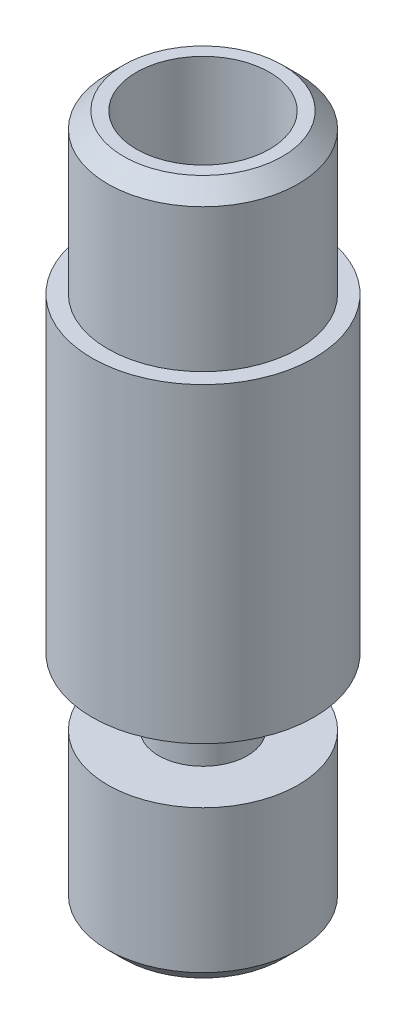
ISO-10303-21;
HEADER;
FILE_DESCRIPTION(('STEP AP214'),'2;1');
FILE_NAME('part.step','',(''),(''),'','','');
FILE_SCHEMA(('AUTOMOTIVE_DESIGN { 1 0 10303 214 1 1 1 1 }'));
ENDSEC;
DATA;
#1=APPLICATION_CONTEXT('core data for automotive mechanical design processes');
#2=APPLICATION_PROTOCOL_DEFINITION('international standard','automotive_design',2000,#1);
#3=PRODUCT_CONTEXT('',#1,'mechanical');
#4=PRODUCT('Part','Part','',(#3));
#5=PRODUCT_RELATED_PRODUCT_CATEGORY('part','',(#4));
#6=PRODUCT_DEFINITION_FORMATION('','',#4);
#7=PRODUCT_DEFINITION_CONTEXT('part definition',#1,'design');
#8=PRODUCT_DEFINITION('design','',#6,#7);
#9=PRODUCT_DEFINITION_SHAPE('','',#8);
#10=(LENGTH_UNIT() NAMED_UNIT(*) SI_UNIT(.MILLI.,.METRE.));
#11=(NAMED_UNIT(*) PLANE_ANGLE_UNIT() SI_UNIT($,.RADIAN.));
#12=(NAMED_UNIT(*) SI_UNIT($,.STERADIAN.) SOLID_ANGLE_UNIT());
#13=UNCERTAINTY_MEASURE_WITH_UNIT(LENGTH_MEASURE(1.E-05),#10,'distance_accuracy_value','');
#14=(GEOMETRIC_REPRESENTATION_CONTEXT(3) GLOBAL_UNCERTAINTY_ASSIGNED_CONTEXT((#13)) GLOBAL_UNIT_ASSIGNED_CONTEXT((#10,
#11,#12)) REPRESENTATION_CONTEXT('',''));
#15=CARTESIAN_POINT('',(0.,0.,0.));
#16=DIRECTION('',(0.,0.,1.));
#17=DIRECTION('',(1.,0.,0.));
#18=AXIS2_PLACEMENT_3D('',#15,#16,#17);
#19=CARTESIAN_POINT('',(0.,5.,0.));
#20=DIRECTION('',(0.,-1.,0.));
#21=DIRECTION('',(0.,0.,-1.));
#22=AXIS2_PLACEMENT_3D('',#19,#20,#21);
#23=CYLINDRICAL_SURFACE('',#22,3.);
#24=CARTESIAN_POINT('',(0.,0.499999999999998,0.));
#25=DIRECTION('',(0.,-1.,0.));
#26=DIRECTION('',(0.,0.,-1.));
#27=AXIS2_PLACEMENT_3D('',#24,#25,#26);
#28=CIRCLE('',#27,3.);
#29=CARTESIAN_POINT('',(0.,0.499999999999998,-3.));
#30=VERTEX_POINT('',#29);
#31=EDGE_CURVE('E67',#30,#30,#28,.T.);
#32=ORIENTED_EDGE('',*,*,#31,.F.);
#33=EDGE_LOOP('',(#32));
#34=FACE_BOUND('',#33,.T.);
#35=CARTESIAN_POINT('',(0.,5.,0.));
#36=DIRECTION('',(0.,-1.,0.));
#37=DIRECTION('',(0.,0.,-1.));
#38=AXIS2_PLACEMENT_3D('',#35,#36,#37);
#39=CIRCLE('',#38,3.);
#40=CARTESIAN_POINT('',(0.,5.,-3.));
#41=VERTEX_POINT('',#40);
#42=EDGE_CURVE('E18',#41,#41,#39,.F.);
#43=ORIENTED_EDGE('',*,*,#42,.F.);
#44=EDGE_LOOP('',(#43));
#45=FACE_BOUND('',#44,.T.);
#46=ADVANCED_FACE('F14',(#34,#45),#23,.T.);
#47=CARTESIAN_POINT('',(-3.001,5.,-3.001));
#48=DIRECTION('',(0.,1.,0.));
#49=DIRECTION('',(0.,0.,1.));
#50=AXIS2_PLACEMENT_3D('',#47,#48,#49);
#51=PLANE('',#50);
#52=CARTESIAN_POINT('',(0.,5.,0.));
#53=DIRECTION('',(0.,-1.,0.));
#54=DIRECTION('',(0.,0.,-1.));
#55=AXIS2_PLACEMENT_3D('',#52,#53,#54);
#56=CIRCLE('',#55,1.4);
#57=CARTESIAN_POINT('',(0.,5.,-1.4));
#58=VERTEX_POINT('',#57);
#59=EDGE_CURVE('E65',#58,#58,#56,.F.);
#60=ORIENTED_EDGE('',*,*,#59,.F.);
#61=EDGE_LOOP('',(#60));
#62=FACE_BOUND('',#61,.T.);
#63=ORIENTED_EDGE('',*,*,#42,.T.);
#64=EDGE_LOOP('',(#63));
#65=FACE_BOUND('',#64,.T.);
#66=ADVANCED_FACE('F114',(#62,#65),#51,.T.);
#67=CARTESIAN_POINT('',(0.,0.499999999999998,0.));
#68=DIRECTION('',(0.,1.,0.));
#69=DIRECTION('',(0.,0.,1.));
#70=AXIS2_PLACEMENT_3D('',#67,#68,#69);
#71=CONICAL_SURFACE('',#70,3.,0.78539816339745);
#72=CARTESIAN_POINT('',(0.,0.,0.));
#73=DIRECTION('',(0.,1.,0.));
#74=DIRECTION('',(0.,0.,1.));
#75=AXIS2_PLACEMENT_3D('',#72,#73,#74);
#76=CIRCLE('',#75,2.5);
#77=CARTESIAN_POINT('',(0.,0.,2.5));
#78=VERTEX_POINT('',#77);
#79=EDGE_CURVE('E62',#78,#78,#76,.F.);
#80=ORIENTED_EDGE('',*,*,#79,.F.);
#81=EDGE_LOOP('',(#80));
#82=FACE_BOUND('',#81,.T.);
#83=ORIENTED_EDGE('',*,*,#31,.T.);
#84=EDGE_LOOP('',(#83));
#85=FACE_BOUND('',#84,.T.);
#86=ADVANCED_FACE('F112',(#82,#85),#71,.T.);
#87=CARTESIAN_POINT('',(0.,7.1,0.));
#88=DIRECTION('',(0.,-1.,0.));
#89=DIRECTION('',(0.,0.,-1.));
#90=AXIS2_PLACEMENT_3D('',#87,#88,#89);
#91=CYLINDRICAL_SURFACE('',#90,1.4);
#92=ORIENTED_EDGE('',*,*,#59,.T.);
#93=EDGE_LOOP('',(#92));
#94=FACE_BOUND('',#93,.T.);
#95=CARTESIAN_POINT('',(0.,7.1,0.));
#96=DIRECTION('',(0.,-1.,0.));
#97=DIRECTION('',(0.,0.,-1.));
#98=AXIS2_PLACEMENT_3D('',#95,#96,#97);
#99=CIRCLE('',#98,1.4);
#100=CARTESIAN_POINT('',(0.,7.1,-1.4));
#101=VERTEX_POINT('',#100);
#102=EDGE_CURVE('E58',#101,#101,#99,.F.);
#103=ORIENTED_EDGE('',*,*,#102,.F.);
#104=EDGE_LOOP('',(#103));
#105=FACE_BOUND('',#104,.T.);
#106=ADVANCED_FACE('F108',(#94,#105),#91,.T.);
#107=CARTESIAN_POINT('',(-2.501,0.,2.501));
#108=DIRECTION('',(0.,-1.,0.));
#109=DIRECTION('',(0.,0.,-1.));
#110=AXIS2_PLACEMENT_3D('',#107,#108,#109);
#111=PLANE('',#110);
#112=CARTESIAN_POINT('',(0.,0.,0.));
#113=DIRECTION('',(0.,1.,0.));
#114=DIRECTION('',(0.,0.,1.));
#115=AXIS2_PLACEMENT_3D('',#112,#113,#114);
#116=CIRCLE('',#115,1.);
#117=CARTESIAN_POINT('',(0.,0.,1.));
#118=VERTEX_POINT('',#117);
#119=EDGE_CURVE('E54',#118,#118,#116,.F.);
#120=ORIENTED_EDGE('',*,*,#119,.F.);
#121=EDGE_LOOP('',(#120));
#122=FACE_BOUND('',#121,.T.);
#123=ORIENTED_EDGE('',*,*,#79,.T.);
#124=EDGE_LOOP('',(#123));
#125=FACE_BOUND('',#124,.T.);
#126=ADVANCED_FACE('F105',(#122,#125),#111,.T.);
#127=CARTESIAN_POINT('',(-3.501,7.1,3.501));
#128=DIRECTION('',(0.,-1.,0.));
#129=DIRECTION('',(0.,0.,-1.));
#130=AXIS2_PLACEMENT_3D('',#127,#128,#129);
#131=PLANE('',#130);
#132=ORIENTED_EDGE('',*,*,#102,.T.);
#133=EDGE_LOOP('',(#132));
#134=FACE_BOUND('',#133,.T.);
#135=CARTESIAN_POINT('',(0.,7.1,0.));
#136=DIRECTION('',(0.,-1.,0.));
#137=DIRECTION('',(0.,0.,-1.));
#138=AXIS2_PLACEMENT_3D('',#135,#136,#137);
#139=CIRCLE('',#138,3.5);
#140=CARTESIAN_POINT('',(0.,7.1,-3.5));
#141=VERTEX_POINT('',#140);
#142=EDGE_CURVE('E50',#141,#141,#139,.F.);
#143=ORIENTED_EDGE('',*,*,#142,.F.);
#144=EDGE_LOOP('',(#143));
#145=FACE_BOUND('',#144,.T.);
#146=ADVANCED_FACE('F101',(#134,#145),#131,.T.);
#147=CARTESIAN_POINT('',(0.,0.,0.));
#148=DIRECTION('',(0.,1.,0.));
#149=DIRECTION('',(0.,0.,1.));
#150=AXIS2_PLACEMENT_3D('',#147,#148,#149);
#151=CYLINDRICAL_SURFACE('',#150,1.);
#152=CARTESIAN_POINT('',(0.,15.8,0.));
#153=DIRECTION('',(0.,-1.,0.));
#154=DIRECTION('',(0.,0.,-1.));
#155=AXIS2_PLACEMENT_3D('',#152,#153,#154);
#156=CIRCLE('',#155,0.999999999999999);
#157=CARTESIAN_POINT('',(0.,15.8,-0.999999999999999));
#158=VERTEX_POINT('',#157);
#159=EDGE_CURVE('E49',#158,#158,#156,.T.);
#160=ORIENTED_EDGE('',*,*,#159,.F.);
#161=EDGE_LOOP('',(#160));
#162=FACE_BOUND('',#161,.T.);
#163=ORIENTED_EDGE('',*,*,#119,.T.);
#164=EDGE_LOOP('',(#163));
#165=FACE_BOUND('',#164,.T.);
#166=ADVANCED_FACE('F98',(#162,#165),#151,.F.);
#167=CARTESIAN_POINT('',(0.,16.9,0.));
#168=DIRECTION('',(0.,-1.,0.));
#169=DIRECTION('',(0.,0.,-1.));
#170=AXIS2_PLACEMENT_3D('',#167,#168,#169);
#171=CYLINDRICAL_SURFACE('',#170,3.5);
#172=ORIENTED_EDGE('',*,*,#142,.T.);
#173=EDGE_LOOP('',(#172));
#174=FACE_BOUND('',#173,.T.);
#175=CARTESIAN_POINT('',(0.,16.9,0.));
#176=DIRECTION('',(0.,-1.,0.));
#177=DIRECTION('',(0.,0.,-1.));
#178=AXIS2_PLACEMENT_3D('',#175,#176,#177);
#179=CIRCLE('',#178,3.5);
#180=CARTESIAN_POINT('',(0.,16.9,-3.5));
#181=VERTEX_POINT('',#180);
#182=EDGE_CURVE('E45',#181,#181,#179,.F.);
#183=ORIENTED_EDGE('',*,*,#182,.F.);
#184=EDGE_LOOP('',(#183));
#185=FACE_BOUND('',#184,.T.);
#186=ADVANCED_FACE('F94',(#174,#185),#171,.T.);
#187=CARTESIAN_POINT('',(0.,15.8,0.));
#188=DIRECTION('',(0.,1.,0.));
#189=DIRECTION('',(0.,0.,1.));
#190=AXIS2_PLACEMENT_3D('',#187,#188,#189);
#191=CONICAL_SURFACE('',#190,0.999999999999999,0.78539816339745);
#192=CARTESIAN_POINT('',(0.,16.9,0.));
#193=DIRECTION('',(0.,-1.,0.));
#194=DIRECTION('',(0.,0.,-1.));
#195=AXIS2_PLACEMENT_3D('',#192,#193,#194);
#196=CIRCLE('',#195,2.1);
#197=CARTESIAN_POINT('',(0.,16.9,-2.1));
#198=VERTEX_POINT('',#197);
#199=EDGE_CURVE('E44',#198,#198,#196,.T.);
#200=ORIENTED_EDGE('',*,*,#199,.F.);
#201=EDGE_LOOP('',(#200));
#202=FACE_BOUND('',#201,.T.);
#203=ORIENTED_EDGE('',*,*,#159,.T.);
#204=EDGE_LOOP('',(#203));
#205=FACE_BOUND('',#204,.T.);
#206=ADVANCED_FACE('F90',(#202,#205),#191,.F.);
#207=CARTESIAN_POINT('',(-3.501,16.9,-3.501));
#208=DIRECTION('',(0.,1.,0.));
#209=DIRECTION('',(0.,0.,1.));
#210=AXIS2_PLACEMENT_3D('',#207,#208,#209);
#211=PLANE('',#210);
#212=CARTESIAN_POINT('',(0.,16.9,0.));
#213=DIRECTION('',(0.,-1.,0.));
#214=DIRECTION('',(0.,0.,-1.));
#215=AXIS2_PLACEMENT_3D('',#212,#213,#214);
#216=CIRCLE('',#215,3.);
#217=CARTESIAN_POINT('',(0.,16.9,-3.));
#218=VERTEX_POINT('',#217);
#219=EDGE_CURVE('E40',#218,#218,#216,.F.);
#220=ORIENTED_EDGE('',*,*,#219,.F.);
#221=EDGE_LOOP('',(#220));
#222=FACE_BOUND('',#221,.T.);
#223=ORIENTED_EDGE('',*,*,#182,.T.);
#224=EDGE_LOOP('',(#223));
#225=FACE_BOUND('',#224,.T.);
#226=ADVANCED_FACE('F93',(#222,#225),#211,.T.);
#227=CARTESIAN_POINT('',(0.,16.9,0.));
#228=DIRECTION('',(0.,1.,0.));
#229=DIRECTION('',(0.,0.,1.));
#230=AXIS2_PLACEMENT_3D('',#227,#228,#229);
#231=CYLINDRICAL_SURFACE('',#230,2.1);
#232=CARTESIAN_POINT('',(0.,21.9,0.));
#233=DIRECTION('',(0.,1.,0.));
#234=DIRECTION('',(0.,0.,1.));
#235=AXIS2_PLACEMENT_3D('',#232,#233,#234);
#236=CIRCLE('',#235,2.1);
#237=CARTESIAN_POINT('',(0.,21.9,2.1));
#238=VERTEX_POINT('',#237);
#239=EDGE_CURVE('E31',#238,#238,#236,.F.);
#240=ORIENTED_EDGE('',*,*,#239,.F.);
#241=EDGE_LOOP('',(#240));
#242=FACE_BOUND('',#241,.T.);
#243=ORIENTED_EDGE('',*,*,#199,.T.);
#244=EDGE_LOOP('',(#243));
#245=FACE_BOUND('',#244,.T.);
#246=ADVANCED_FACE('F88',(#242,#245),#231,.F.);
#247=CARTESIAN_POINT('',(0.,21.4,0.));
#248=DIRECTION('',(0.,-1.,0.));
#249=DIRECTION('',(0.,0.,-1.));
#250=AXIS2_PLACEMENT_3D('',#247,#248,#249);
#251=CYLINDRICAL_SURFACE('',#250,3.);
#252=ORIENTED_EDGE('',*,*,#219,.T.);
#253=EDGE_LOOP('',(#252));
#254=FACE_BOUND('',#253,.T.);
#255=CARTESIAN_POINT('',(0.,21.4,0.));
#256=DIRECTION('',(0.,1.,0.));
#257=DIRECTION('',(0.,0.,1.));
#258=AXIS2_PLACEMENT_3D('',#255,#256,#257);
#259=CIRCLE('',#258,3.);
#260=CARTESIAN_POINT('',(0.,21.4,3.));
#261=VERTEX_POINT('',#260);
#262=EDGE_CURVE('E23',#261,#261,#259,.T.);
#263=ORIENTED_EDGE('',*,*,#262,.F.);
#264=EDGE_LOOP('',(#263));
#265=FACE_BOUND('',#264,.T.);
#266=ADVANCED_FACE('F131',(#254,#265),#251,.T.);
#267=CARTESIAN_POINT('',(-2.501,21.9,-2.501));
#268=DIRECTION('',(0.,1.,0.));
#269=DIRECTION('',(0.,0.,1.));
#270=AXIS2_PLACEMENT_3D('',#267,#268,#269);
#271=PLANE('',#270);
#272=ORIENTED_EDGE('',*,*,#239,.T.);
#273=EDGE_LOOP('',(#272));
#274=FACE_BOUND('',#273,.T.);
#275=CARTESIAN_POINT('',(0.,21.9,0.));
#276=DIRECTION('',(0.,-1.,0.));
#277=DIRECTION('',(0.,0.,-1.));
#278=AXIS2_PLACEMENT_3D('',#275,#276,#277);
#279=CIRCLE('',#278,2.5);
#280=CARTESIAN_POINT('',(0.,21.9,-2.5));
#281=VERTEX_POINT('',#280);
#282=EDGE_CURVE('E10',#281,#281,#279,.T.);
#283=ORIENTED_EDGE('',*,*,#282,.F.);
#284=EDGE_LOOP('',(#283));
#285=FACE_BOUND('',#284,.T.);
#286=ADVANCED_FACE('F127',(#274,#285),#271,.T.);
#287=CARTESIAN_POINT('',(0.,21.4,0.));
#288=DIRECTION('',(0.,-1.,0.));
#289=DIRECTION('',(0.,0.,-1.));
#290=AXIS2_PLACEMENT_3D('',#287,#288,#289);
#291=CONICAL_SURFACE('',#290,3.,0.785398163397448);
#292=ORIENTED_EDGE('',*,*,#282,.T.);
#293=EDGE_LOOP('',(#292));
#294=FACE_BOUND('',#293,.T.);
#295=ORIENTED_EDGE('',*,*,#262,.T.);
#296=EDGE_LOOP('',(#295));
#297=FACE_BOUND('',#296,.T.);
#298=ADVANCED_FACE('F16',(#294,#297),#291,.T.);
#299=CLOSED_SHELL('',(#46,#66,#86,#106,#126,#146,#166,#186,#206,#226,#246,#266,#286,#298));
#300=MANIFOLD_SOLID_BREP('B1',#299);
#301=ADVANCED_BREP_SHAPE_REPRESENTATION('',(#18,#300),#14);
#302=SHAPE_DEFINITION_REPRESENTATION(#9,#301);
ENDSEC;
END-ISO-10303-21;
